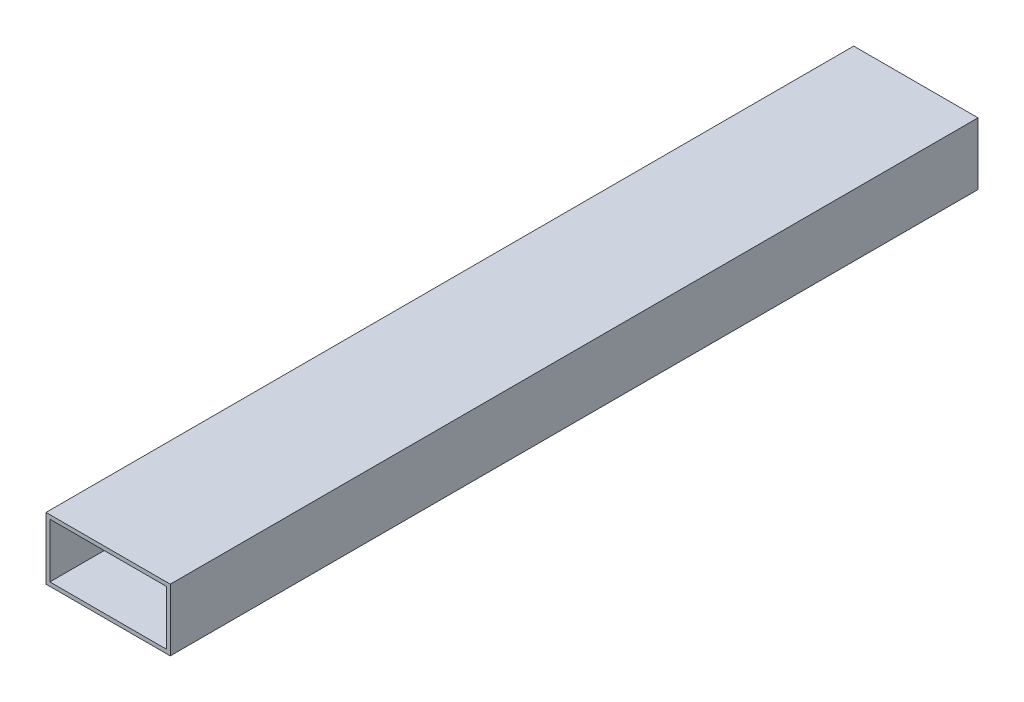
ISO-10303-21;
HEADER;
FILE_DESCRIPTION(('STEP AP214'),'2;1');
FILE_NAME('part.step','',(''),(''),'','','');
FILE_SCHEMA(('AUTOMOTIVE_DESIGN { 1 0 10303 214 1 1 1 1 }'));
ENDSEC;
DATA;
#1=APPLICATION_CONTEXT('core data for automotive mechanical design processes');
#2=APPLICATION_PROTOCOL_DEFINITION('international standard','automotive_design',2000,#1);
#3=PRODUCT_CONTEXT('',#1,'mechanical');
#4=PRODUCT('Part','Part','',(#3));
#5=PRODUCT_RELATED_PRODUCT_CATEGORY('part','',(#4));
#6=PRODUCT_DEFINITION_FORMATION('','',#4);
#7=PRODUCT_DEFINITION_CONTEXT('part definition',#1,'design');
#8=PRODUCT_DEFINITION('design','',#6,#7);
#9=PRODUCT_DEFINITION_SHAPE('','',#8);
#10=(LENGTH_UNIT() NAMED_UNIT(*) SI_UNIT(.MILLI.,.METRE.));
#11=(NAMED_UNIT(*) PLANE_ANGLE_UNIT() SI_UNIT($,.RADIAN.));
#12=(NAMED_UNIT(*) SI_UNIT($,.STERADIAN.) SOLID_ANGLE_UNIT());
#13=UNCERTAINTY_MEASURE_WITH_UNIT(LENGTH_MEASURE(1.E-05),#10,'distance_accuracy_value','');
#14=(GEOMETRIC_REPRESENTATION_CONTEXT(3) GLOBAL_UNCERTAINTY_ASSIGNED_CONTEXT((#13)) GLOBAL_UNIT_ASSIGNED_CONTEXT((#10,
#11,#12)) REPRESENTATION_CONTEXT('',''));
#15=CARTESIAN_POINT('',(0.,0.,0.));
#16=DIRECTION('',(0.,0.,1.));
#17=DIRECTION('',(1.,0.,0.));
#18=AXIS2_PLACEMENT_3D('',#15,#16,#17);
#19=CARTESIAN_POINT('',(0.,0.,330.2));
#20=DIRECTION('',(0.,0.,-1.));
#21=DIRECTION('',(-1.,0.,0.));
#22=AXIS2_PLACEMENT_3D('',#19,#20,#21);
#23=PLANE('',#22);
#24=DIRECTION('',(0.,-1.,0.));
#25=VECTOR('',#24,1.);
#26=CARTESIAN_POINT('',(0.,0.,330.2));
#27=LINE('',#26,#25);
#28=CARTESIAN_POINT('',(0.,25.4,330.2));
#29=VERTEX_POINT('',#28);
#30=CARTESIAN_POINT('',(0.,0.,330.2));
#31=VERTEX_POINT('',#30);
#32=EDGE_CURVE('E159',#29,#31,#27,.T.);
#33=ORIENTED_EDGE('',*,*,#32,.T.);
#34=DIRECTION('',(1.,0.,0.));
#35=VECTOR('',#34,1.);
#36=CARTESIAN_POINT('',(0.,0.,330.2));
#37=LINE('',#36,#35);
#38=CARTESIAN_POINT('',(50.8,0.,330.2));
#39=VERTEX_POINT('',#38);
#40=EDGE_CURVE('E163',#31,#39,#37,.T.);
#41=ORIENTED_EDGE('',*,*,#40,.T.);
#42=DIRECTION('',(0.,1.,0.));
#43=VECTOR('',#42,1.);
#44=CARTESIAN_POINT('',(50.8,0.,330.2));
#45=LINE('',#44,#43);
#46=CARTESIAN_POINT('',(50.8,25.4,330.2));
#47=VERTEX_POINT('',#46);
#48=EDGE_CURVE('E167',#39,#47,#45,.T.);
#49=ORIENTED_EDGE('',*,*,#48,.T.);
#50=DIRECTION('',(-1.,0.,0.));
#51=VECTOR('',#50,1.);
#52=CARTESIAN_POINT('',(0.,25.4,330.2));
#53=LINE('',#52,#51);
#54=EDGE_CURVE('E170',#47,#29,#53,.T.);
#55=ORIENTED_EDGE('',*,*,#54,.T.);
#56=EDGE_LOOP('',(#33,#41,#49,#55));
#57=FACE_BOUND('',#56,.T.);
#58=DIRECTION('',(0.,-1.,0.));
#59=VECTOR('',#58,1.);
#60=CARTESIAN_POINT('',(1.5875,1.5875,330.2));
#61=LINE('',#60,#59);
#62=CARTESIAN_POINT('',(1.5875,23.8125,330.2));
#63=VERTEX_POINT('',#62);
#64=CARTESIAN_POINT('',(1.5875,1.5875,330.2));
#65=VERTEX_POINT('',#64);
#66=EDGE_CURVE('E111',#63,#65,#61,.T.);
#67=ORIENTED_EDGE('',*,*,#66,.F.);
#68=DIRECTION('',(-1.,0.,0.));
#69=VECTOR('',#68,1.);
#70=CARTESIAN_POINT('',(1.5875,23.8125,330.2));
#71=LINE('',#70,#69);
#72=CARTESIAN_POINT('',(49.2125,23.8125,330.2));
#73=VERTEX_POINT('',#72);
#74=EDGE_CURVE('E137',#73,#63,#71,.T.);
#75=ORIENTED_EDGE('',*,*,#74,.F.);
#76=DIRECTION('',(0.,1.,0.));
#77=VECTOR('',#76,1.);
#78=CARTESIAN_POINT('',(49.2125,1.5875,330.2));
#79=LINE('',#78,#77);
#80=CARTESIAN_POINT('',(49.2125,1.5875,330.2));
#81=VERTEX_POINT('',#80);
#82=EDGE_CURVE('E133',#81,#73,#79,.T.);
#83=ORIENTED_EDGE('',*,*,#82,.F.);
#84=DIRECTION('',(1.,0.,0.));
#85=VECTOR('',#84,1.);
#86=CARTESIAN_POINT('',(1.5875,1.5875,330.2));
#87=LINE('',#86,#85);
#88=EDGE_CURVE('E120',#65,#81,#87,.T.);
#89=ORIENTED_EDGE('',*,*,#88,.F.);
#90=EDGE_LOOP('',(#67,#75,#83,#89));
#91=FACE_BOUND('',#90,.T.);
#92=ADVANCED_FACE('F45',(#57,#91),#23,.F.);
#93=CARTESIAN_POINT('',(0.,0.,0.));
#94=DIRECTION('',(0.,0.,-1.));
#95=DIRECTION('',(-1.,0.,0.));
#96=AXIS2_PLACEMENT_3D('',#93,#94,#95);
#97=PLANE('',#96);
#98=DIRECTION('',(0.,-1.,0.));
#99=VECTOR('',#98,1.);
#100=CARTESIAN_POINT('',(0.,0.,0.));
#101=LINE('',#100,#99);
#102=CARTESIAN_POINT('',(0.,25.4,0.));
#103=VERTEX_POINT('',#102);
#104=CARTESIAN_POINT('',(0.,0.,0.));
#105=VERTEX_POINT('',#104);
#106=EDGE_CURVE('E129',#103,#105,#101,.T.);
#107=ORIENTED_EDGE('',*,*,#106,.F.);
#108=DIRECTION('',(-1.,0.,0.));
#109=VECTOR('',#108,1.);
#110=CARTESIAN_POINT('',(0.,25.4,0.));
#111=LINE('',#110,#109);
#112=CARTESIAN_POINT('',(50.8,25.4,0.));
#113=VERTEX_POINT('',#112);
#114=EDGE_CURVE('E164',#113,#103,#111,.T.);
#115=ORIENTED_EDGE('',*,*,#114,.F.);
#116=DIRECTION('',(0.,1.,0.));
#117=VECTOR('',#116,1.);
#118=CARTESIAN_POINT('',(50.8,0.,0.));
#119=LINE('',#118,#117);
#120=CARTESIAN_POINT('',(50.8,0.,0.));
#121=VERTEX_POINT('',#120);
#122=EDGE_CURVE('E180',#121,#113,#119,.T.);
#123=ORIENTED_EDGE('',*,*,#122,.F.);
#124=DIRECTION('',(1.,0.,0.));
#125=VECTOR('',#124,1.);
#126=CARTESIAN_POINT('',(0.,0.,0.));
#127=LINE('',#126,#125);
#128=EDGE_CURVE('E177',#105,#121,#127,.T.);
#129=ORIENTED_EDGE('',*,*,#128,.F.);
#130=EDGE_LOOP('',(#107,#115,#123,#129));
#131=FACE_BOUND('',#130,.T.);
#132=DIRECTION('',(-1.,0.,0.));
#133=VECTOR('',#132,1.);
#134=CARTESIAN_POINT('',(1.5875,23.8125,0.));
#135=LINE('',#134,#133);
#136=CARTESIAN_POINT('',(49.2125,23.8125,0.));
#137=VERTEX_POINT('',#136);
#138=CARTESIAN_POINT('',(1.5875,23.8125,0.));
#139=VERTEX_POINT('',#138);
#140=EDGE_CURVE('E121',#137,#139,#135,.T.);
#141=ORIENTED_EDGE('',*,*,#140,.T.);
#142=DIRECTION('',(0.,-1.,0.));
#143=VECTOR('',#142,1.);
#144=CARTESIAN_POINT('',(1.5875,1.5875,0.));
#145=LINE('',#144,#143);
#146=CARTESIAN_POINT('',(1.5875,1.5875,0.));
#147=VERTEX_POINT('',#146);
#148=EDGE_CURVE('E69',#139,#147,#145,.T.);
#149=ORIENTED_EDGE('',*,*,#148,.T.);
#150=DIRECTION('',(1.,0.,0.));
#151=VECTOR('',#150,1.);
#152=CARTESIAN_POINT('',(1.5875,1.5875,0.));
#153=LINE('',#152,#151);
#154=CARTESIAN_POINT('',(49.2125,1.5875,0.));
#155=VERTEX_POINT('',#154);
#156=EDGE_CURVE('E127',#147,#155,#153,.T.);
#157=ORIENTED_EDGE('',*,*,#156,.T.);
#158=DIRECTION('',(0.,1.,0.));
#159=VECTOR('',#158,1.);
#160=CARTESIAN_POINT('',(49.2125,1.5875,0.));
#161=LINE('',#160,#159);
#162=EDGE_CURVE('E146',#155,#137,#161,.T.);
#163=ORIENTED_EDGE('',*,*,#162,.T.);
#164=EDGE_LOOP('',(#141,#149,#157,#163));
#165=FACE_BOUND('',#164,.T.);
#166=ADVANCED_FACE('F203',(#131,#165),#97,.T.);
#167=CARTESIAN_POINT('',(0.,0.,330.2));
#168=DIRECTION('',(1.,0.,0.));
#169=DIRECTION('',(0.,1.,0.));
#170=AXIS2_PLACEMENT_3D('',#167,#168,#169);
#171=PLANE('',#170);
#172=ORIENTED_EDGE('',*,*,#106,.T.);
#173=DIRECTION('',(0.,0.,-1.));
#174=VECTOR('',#173,1.);
#175=CARTESIAN_POINT('',(0.,0.,330.2));
#176=LINE('',#175,#174);
#177=EDGE_CURVE('E11',#31,#105,#176,.T.);
#178=ORIENTED_EDGE('',*,*,#177,.F.);
#179=ORIENTED_EDGE('',*,*,#32,.F.);
#180=DIRECTION('',(0.,0.,-1.));
#181=VECTOR('',#180,1.);
#182=CARTESIAN_POINT('',(0.,25.4,330.2));
#183=LINE('',#182,#181);
#184=EDGE_CURVE('E173',#29,#103,#183,.T.);
#185=ORIENTED_EDGE('',*,*,#184,.T.);
#186=EDGE_LOOP('',(#172,#178,#179,#185));
#187=FACE_BOUND('',#186,.T.);
#188=ADVANCED_FACE('F47',(#187),#171,.F.);
#189=CARTESIAN_POINT('',(0.,0.,330.2));
#190=DIRECTION('',(0.,1.,0.));
#191=DIRECTION('',(0.,0.,1.));
#192=AXIS2_PLACEMENT_3D('',#189,#190,#191);
#193=PLANE('',#192);
#194=ORIENTED_EDGE('',*,*,#128,.T.);
#195=DIRECTION('',(0.,0.,-1.));
#196=VECTOR('',#195,1.);
#197=CARTESIAN_POINT('',(50.8,0.,330.2));
#198=LINE('',#197,#196);
#199=EDGE_CURVE('E54',#39,#121,#198,.T.);
#200=ORIENTED_EDGE('',*,*,#199,.F.);
#201=ORIENTED_EDGE('',*,*,#40,.F.);
#202=ORIENTED_EDGE('',*,*,#177,.T.);
#203=EDGE_LOOP('',(#194,#200,#201,#202));
#204=FACE_BOUND('',#203,.T.);
#205=ADVANCED_FACE('F213',(#204),#193,.F.);
#206=CARTESIAN_POINT('',(50.8,0.,330.2));
#207=DIRECTION('',(-1.,0.,0.));
#208=DIRECTION('',(0.,-1.,0.));
#209=AXIS2_PLACEMENT_3D('',#206,#207,#208);
#210=PLANE('',#209);
#211=ORIENTED_EDGE('',*,*,#122,.T.);
#212=DIRECTION('',(0.,0.,-1.));
#213=VECTOR('',#212,1.);
#214=CARTESIAN_POINT('',(50.8,25.4,330.2));
#215=LINE('',#214,#213);
#216=EDGE_CURVE('E188',#47,#113,#215,.T.);
#217=ORIENTED_EDGE('',*,*,#216,.F.);
#218=ORIENTED_EDGE('',*,*,#48,.F.);
#219=ORIENTED_EDGE('',*,*,#199,.T.);
#220=EDGE_LOOP('',(#211,#217,#218,#219));
#221=FACE_BOUND('',#220,.T.);
#222=ADVANCED_FACE('F197',(#221),#210,.F.);
#223=CARTESIAN_POINT('',(0.,25.4,330.2));
#224=DIRECTION('',(0.,-1.,0.));
#225=DIRECTION('',(0.,0.,-1.));
#226=AXIS2_PLACEMENT_3D('',#223,#224,#225);
#227=PLANE('',#226);
#228=ORIENTED_EDGE('',*,*,#114,.T.);
#229=ORIENTED_EDGE('',*,*,#184,.F.);
#230=ORIENTED_EDGE('',*,*,#54,.F.);
#231=ORIENTED_EDGE('',*,*,#216,.T.);
#232=EDGE_LOOP('',(#228,#229,#230,#231));
#233=FACE_BOUND('',#232,.T.);
#234=ADVANCED_FACE('F207',(#233),#227,.F.);
#235=CARTESIAN_POINT('',(1.5875,1.5875,330.2));
#236=DIRECTION('',(1.,0.,0.));
#237=DIRECTION('',(0.,0.,-1.));
#238=AXIS2_PLACEMENT_3D('',#235,#236,#237);
#239=PLANE('',#238);
#240=ORIENTED_EDGE('',*,*,#148,.F.);
#241=DIRECTION('',(0.,0.,-1.));
#242=VECTOR('',#241,1.);
#243=CARTESIAN_POINT('',(1.5875,23.8125,330.2));
#244=LINE('',#243,#242);
#245=EDGE_CURVE('E115',#63,#139,#244,.T.);
#246=ORIENTED_EDGE('',*,*,#245,.F.);
#247=ORIENTED_EDGE('',*,*,#66,.T.);
#248=DIRECTION('',(0.,0.,-1.));
#249=VECTOR('',#248,1.);
#250=CARTESIAN_POINT('',(1.5875,1.5875,330.2));
#251=LINE('',#250,#249);
#252=EDGE_CURVE('E114',#65,#147,#251,.T.);
#253=ORIENTED_EDGE('',*,*,#252,.T.);
#254=EDGE_LOOP('',(#240,#246,#247,#253));
#255=FACE_BOUND('',#254,.T.);
#256=ADVANCED_FACE('F113',(#255),#239,.T.);
#257=CARTESIAN_POINT('',(1.5875,1.5875,330.2));
#258=DIRECTION('',(0.,1.,0.));
#259=DIRECTION('',(0.,0.,1.));
#260=AXIS2_PLACEMENT_3D('',#257,#258,#259);
#261=PLANE('',#260);
#262=ORIENTED_EDGE('',*,*,#156,.F.);
#263=ORIENTED_EDGE('',*,*,#252,.F.);
#264=ORIENTED_EDGE('',*,*,#88,.T.);
#265=DIRECTION('',(0.,0.,-1.));
#266=VECTOR('',#265,1.);
#267=CARTESIAN_POINT('',(49.2125,1.5875,330.2));
#268=LINE('',#267,#266);
#269=EDGE_CURVE('E130',#81,#155,#268,.T.);
#270=ORIENTED_EDGE('',*,*,#269,.T.);
#271=EDGE_LOOP('',(#262,#263,#264,#270));
#272=FACE_BOUND('',#271,.T.);
#273=ADVANCED_FACE('F124',(#272),#261,.T.);
#274=CARTESIAN_POINT('',(49.2125,1.5875,330.2));
#275=DIRECTION('',(-1.,0.,0.));
#276=DIRECTION('',(0.,0.,1.));
#277=AXIS2_PLACEMENT_3D('',#274,#275,#276);
#278=PLANE('',#277);
#279=ORIENTED_EDGE('',*,*,#162,.F.);
#280=ORIENTED_EDGE('',*,*,#269,.F.);
#281=ORIENTED_EDGE('',*,*,#82,.T.);
#282=DIRECTION('',(0.,0.,-1.));
#283=VECTOR('',#282,1.);
#284=CARTESIAN_POINT('',(49.2125,23.8125,330.2));
#285=LINE('',#284,#283);
#286=EDGE_CURVE('E61',#73,#137,#285,.T.);
#287=ORIENTED_EDGE('',*,*,#286,.T.);
#288=EDGE_LOOP('',(#279,#280,#281,#287));
#289=FACE_BOUND('',#288,.T.);
#290=ADVANCED_FACE('F236',(#289),#278,.T.);
#291=CARTESIAN_POINT('',(1.5875,23.8125,330.2));
#292=DIRECTION('',(0.,-1.,0.));
#293=DIRECTION('',(0.,0.,-1.));
#294=AXIS2_PLACEMENT_3D('',#291,#292,#293);
#295=PLANE('',#294);
#296=ORIENTED_EDGE('',*,*,#140,.F.);
#297=ORIENTED_EDGE('',*,*,#286,.F.);
#298=ORIENTED_EDGE('',*,*,#74,.T.);
#299=ORIENTED_EDGE('',*,*,#245,.T.);
#300=EDGE_LOOP('',(#296,#297,#298,#299));
#301=FACE_BOUND('',#300,.T.);
#302=ADVANCED_FACE('F240',(#301),#295,.T.);
#303=CLOSED_SHELL('',(#92,#166,#188,#205,#222,#234,#256,#273,#290,#302));
#304=MANIFOLD_SOLID_BREP('B2',#303);
#305=ADVANCED_BREP_SHAPE_REPRESENTATION('',(#18,#304),#14);
#306=SHAPE_DEFINITION_REPRESENTATION(#9,#305);
ENDSEC;
END-ISO-10303-21;
